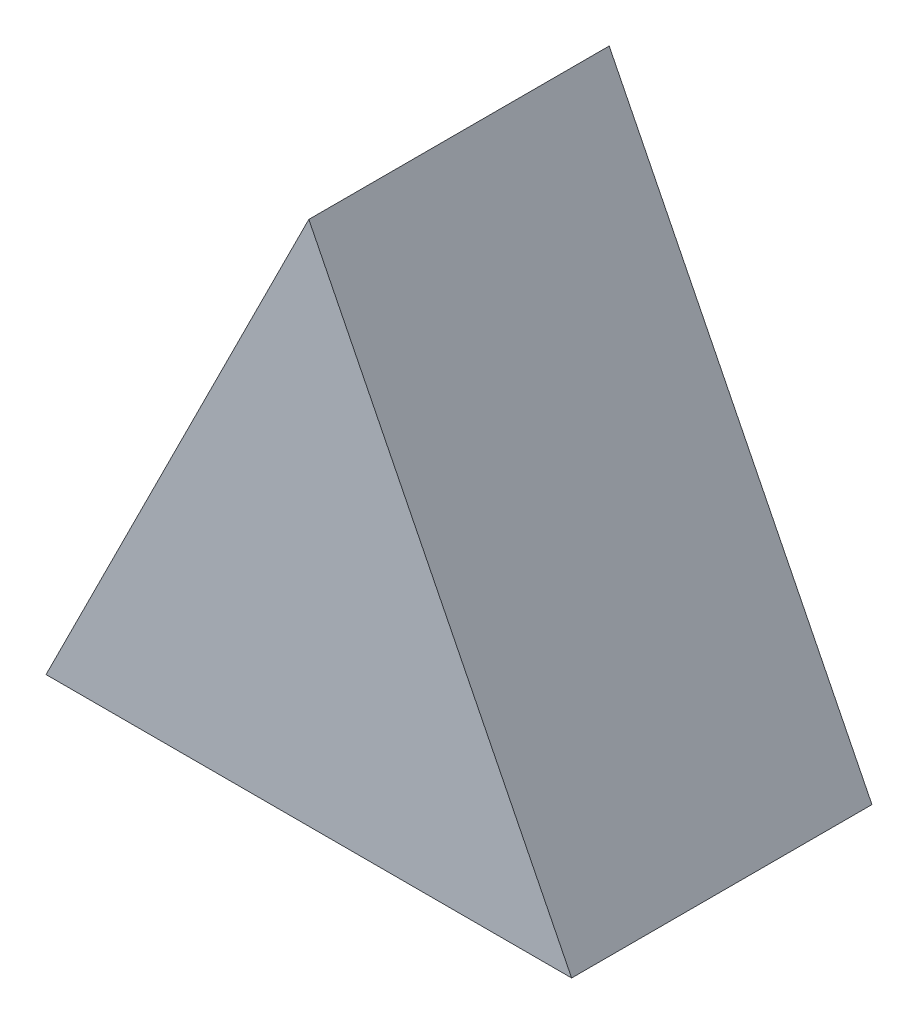
ISO-10303-21;
HEADER;
FILE_DESCRIPTION(('STEP AP214'),'2;1');
FILE_NAME('part.step','',(''),(''),'','','');
FILE_SCHEMA(('AUTOMOTIVE_DESIGN { 1 0 10303 214 1 1 1 1 }'));
ENDSEC;
DATA;
#1=APPLICATION_CONTEXT('core data for automotive mechanical design processes');
#2=APPLICATION_PROTOCOL_DEFINITION('international standard','automotive_design',2000,#1);
#3=PRODUCT_CONTEXT('',#1,'mechanical');
#4=PRODUCT('Part','Part','',(#3));
#5=PRODUCT_RELATED_PRODUCT_CATEGORY('part','',(#4));
#6=PRODUCT_DEFINITION_FORMATION('','',#4);
#7=PRODUCT_DEFINITION_CONTEXT('part definition',#1,'design');
#8=PRODUCT_DEFINITION('design','',#6,#7);
#9=PRODUCT_DEFINITION_SHAPE('','',#8);
#10=(LENGTH_UNIT() NAMED_UNIT(*) SI_UNIT(.MILLI.,.METRE.));
#11=(NAMED_UNIT(*) PLANE_ANGLE_UNIT() SI_UNIT($,.RADIAN.));
#12=(NAMED_UNIT(*) SI_UNIT($,.STERADIAN.) SOLID_ANGLE_UNIT());
#13=UNCERTAINTY_MEASURE_WITH_UNIT(LENGTH_MEASURE(1.E-05),#10,'distance_accuracy_value','');
#14=(GEOMETRIC_REPRESENTATION_CONTEXT(3) GLOBAL_UNCERTAINTY_ASSIGNED_CONTEXT((#13)) GLOBAL_UNIT_ASSIGNED_CONTEXT((#10,
#11,#12)) REPRESENTATION_CONTEXT('',''));
#15=CARTESIAN_POINT('',(0.,0.,0.));
#16=DIRECTION('',(0.,0.,1.));
#17=DIRECTION('',(1.,0.,0.));
#18=AXIS2_PLACEMENT_3D('',#15,#16,#17);
#19=CARTESIAN_POINT('',(-23.2658959537572,-17.2976878612717,20.));
#20=DIRECTION('',(0.894427190999916,-0.447213595499958,0.));
#21=DIRECTION('',(0.447213595499958,0.894427190999916,0.));
#22=AXIS2_PLACEMENT_3D('',#19,#20,#21);
#23=PLANE('',#22);
#24=DIRECTION('',(-0.447213595499958,-0.894427190999916,0.));
#25=VECTOR('',#24,1.);
#26=CARTESIAN_POINT('',(-23.2658959537572,-17.2976878612717,0.));
#27=LINE('',#26,#25);
#28=CARTESIAN_POINT('',(-5.76589595375722,17.7023121387283,0.));
#29=VERTEX_POINT('',#28);
#30=CARTESIAN_POINT('',(-23.2658959537572,-17.2976878612717,0.));
#31=VERTEX_POINT('',#30);
#32=EDGE_CURVE('E80',#29,#31,#27,.T.);
#33=ORIENTED_EDGE('',*,*,#32,.T.);
#34=DIRECTION('',(0.,0.,-1.));
#35=VECTOR('',#34,1.);
#36=CARTESIAN_POINT('',(-23.2658959537572,-17.2976878612717,20.));
#37=LINE('',#36,#35);
#38=CARTESIAN_POINT('',(-23.2658959537572,-17.2976878612717,20.));
#39=VERTEX_POINT('',#38);
#40=EDGE_CURVE('E11',#39,#31,#37,.T.);
#41=ORIENTED_EDGE('',*,*,#40,.F.);
#42=DIRECTION('',(-0.447213595499958,-0.894427190999916,0.));
#43=VECTOR('',#42,1.);
#44=CARTESIAN_POINT('',(-23.2658959537572,-17.2976878612717,20.));
#45=LINE('',#44,#43);
#46=CARTESIAN_POINT('',(-5.76589595375722,17.7023121387283,20.));
#47=VERTEX_POINT('',#46);
#48=EDGE_CURVE('E73',#47,#39,#45,.T.);
#49=ORIENTED_EDGE('',*,*,#48,.F.);
#50=DIRECTION('',(0.,0.,-1.));
#51=VECTOR('',#50,1.);
#52=CARTESIAN_POINT('',(-5.76589595375722,17.7023121387283,20.));
#53=LINE('',#52,#51);
#54=EDGE_CURVE('E81',#47,#29,#53,.T.);
#55=ORIENTED_EDGE('',*,*,#54,.T.);
#56=EDGE_LOOP('',(#33,#41,#49,#55));
#57=FACE_BOUND('',#56,.T.);
#58=ADVANCED_FACE('F33',(#57),#23,.F.);
#59=CARTESIAN_POINT('',(11.7341040462428,-17.2976878612717,20.));
#60=DIRECTION('',(0.,1.,0.));
#61=DIRECTION('',(-1.,0.,0.));
#62=AXIS2_PLACEMENT_3D('',#59,#60,#61);
#63=PLANE('',#62);
#64=DIRECTION('',(1.,0.,0.));
#65=VECTOR('',#64,1.);
#66=CARTESIAN_POINT('',(11.7341040462428,-17.2976878612717,0.));
#67=LINE('',#66,#65);
#68=CARTESIAN_POINT('',(11.7341040462428,-17.2976878612717,0.));
#69=VERTEX_POINT('',#68);
#70=EDGE_CURVE('E61',#31,#69,#67,.T.);
#71=ORIENTED_EDGE('',*,*,#70,.T.);
#72=DIRECTION('',(0.,0.,-1.));
#73=VECTOR('',#72,1.);
#74=CARTESIAN_POINT('',(11.7341040462428,-17.2976878612717,20.));
#75=LINE('',#74,#73);
#76=CARTESIAN_POINT('',(11.7341040462428,-17.2976878612717,20.));
#77=VERTEX_POINT('',#76);
#78=EDGE_CURVE('E41',#77,#69,#75,.T.);
#79=ORIENTED_EDGE('',*,*,#78,.F.);
#80=DIRECTION('',(1.,0.,0.));
#81=VECTOR('',#80,1.);
#82=CARTESIAN_POINT('',(11.7341040462428,-17.2976878612717,20.));
#83=LINE('',#82,#81);
#84=EDGE_CURVE('E69',#39,#77,#83,.T.);
#85=ORIENTED_EDGE('',*,*,#84,.F.);
#86=ORIENTED_EDGE('',*,*,#40,.T.);
#87=EDGE_LOOP('',(#71,#79,#85,#86));
#88=FACE_BOUND('',#87,.T.);
#89=ADVANCED_FACE('F70',(#88),#63,.F.);
#90=CARTESIAN_POINT('',(-5.76589595375722,17.7023121387283,20.));
#91=DIRECTION('',(-0.894427190999916,-0.447213595499958,0.));
#92=DIRECTION('',(0.447213595499958,-0.894427190999916,0.));
#93=AXIS2_PLACEMENT_3D('',#90,#91,#92);
#94=PLANE('',#93);
#95=DIRECTION('',(-0.447213595499958,0.894427190999916,0.));
#96=VECTOR('',#95,1.);
#97=CARTESIAN_POINT('',(-5.76589595375722,17.7023121387283,0.));
#98=LINE('',#97,#96);
#99=EDGE_CURVE('E66',#69,#29,#98,.T.);
#100=ORIENTED_EDGE('',*,*,#99,.T.);
#101=ORIENTED_EDGE('',*,*,#54,.F.);
#102=DIRECTION('',(-0.447213595499958,0.894427190999916,0.));
#103=VECTOR('',#102,1.);
#104=CARTESIAN_POINT('',(-5.76589595375722,17.7023121387283,20.));
#105=LINE('',#104,#103);
#106=EDGE_CURVE('E49',#77,#47,#105,.T.);
#107=ORIENTED_EDGE('',*,*,#106,.F.);
#108=ORIENTED_EDGE('',*,*,#78,.T.);
#109=EDGE_LOOP('',(#100,#101,#107,#108));
#110=FACE_BOUND('',#109,.T.);
#111=ADVANCED_FACE('F88',(#110),#94,.F.);
#112=CARTESIAN_POINT('',(0.,0.,20.));
#113=DIRECTION('',(0.,0.,1.));
#114=DIRECTION('',(1.,0.,0.));
#115=AXIS2_PLACEMENT_3D('',#112,#113,#114);
#116=PLANE('',#115);
#117=ORIENTED_EDGE('',*,*,#48,.T.);
#118=ORIENTED_EDGE('',*,*,#84,.T.);
#119=ORIENTED_EDGE('',*,*,#106,.T.);
#120=EDGE_LOOP('',(#117,#118,#119));
#121=FACE_BOUND('',#120,.T.);
#122=ADVANCED_FACE('F76',(#121),#116,.T.);
#123=CARTESIAN_POINT('',(0.,0.,0.));
#124=DIRECTION('',(0.,0.,1.));
#125=DIRECTION('',(1.,0.,0.));
#126=AXIS2_PLACEMENT_3D('',#123,#124,#125);
#127=PLANE('',#126);
#128=ORIENTED_EDGE('',*,*,#32,.F.);
#129=ORIENTED_EDGE('',*,*,#99,.F.);
#130=ORIENTED_EDGE('',*,*,#70,.F.);
#131=EDGE_LOOP('',(#128,#129,#130));
#132=FACE_BOUND('',#131,.T.);
#133=ADVANCED_FACE('F89',(#132),#127,.F.);
#134=CLOSED_SHELL('',(#58,#89,#111,#122,#133));
#135=MANIFOLD_SOLID_BREP('B2',#134);
#136=ADVANCED_BREP_SHAPE_REPRESENTATION('',(#18,#135),#14);
#137=SHAPE_DEFINITION_REPRESENTATION(#9,#136);
ENDSEC;
END-ISO-10303-21;
